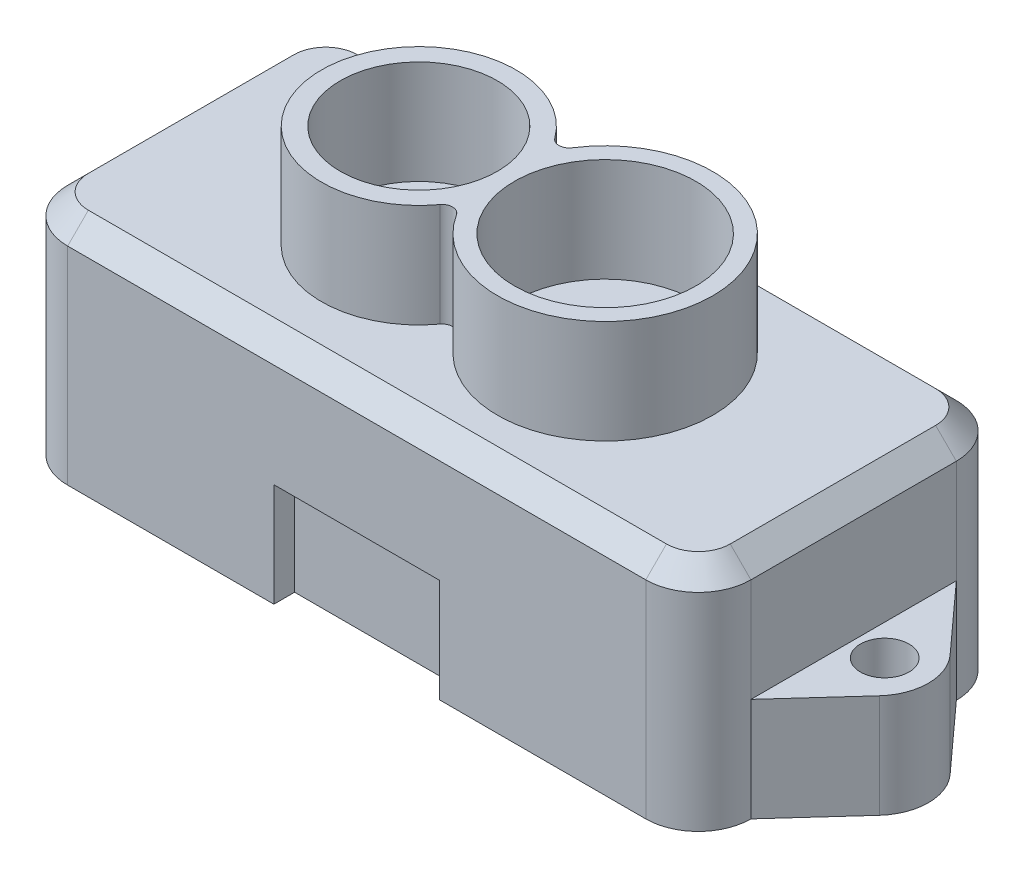
ISO-10303-21;
HEADER;
FILE_DESCRIPTION(('STEP AP214'),'2;1');
FILE_NAME('part.step','',(''),(''),'','','');
FILE_SCHEMA(('AUTOMOTIVE_DESIGN { 1 0 10303 214 1 1 1 1 }'));
ENDSEC;
DATA;
#1=APPLICATION_CONTEXT('core data for automotive mechanical design processes');
#2=APPLICATION_PROTOCOL_DEFINITION('international standard','automotive_design',2000,#1);
#3=PRODUCT_CONTEXT('',#1,'mechanical');
#4=PRODUCT('Part','Part','',(#3));
#5=PRODUCT_RELATED_PRODUCT_CATEGORY('part','',(#4));
#6=PRODUCT_DEFINITION_FORMATION('','',#4);
#7=PRODUCT_DEFINITION_CONTEXT('part definition',#1,'design');
#8=PRODUCT_DEFINITION('design','',#6,#7);
#9=PRODUCT_DEFINITION_SHAPE('','',#8);
#10=(LENGTH_UNIT() NAMED_UNIT(*) SI_UNIT(.MILLI.,.METRE.));
#11=(NAMED_UNIT(*) PLANE_ANGLE_UNIT() SI_UNIT($,.RADIAN.));
#12=(NAMED_UNIT(*) SI_UNIT($,.STERADIAN.) SOLID_ANGLE_UNIT());
#13=UNCERTAINTY_MEASURE_WITH_UNIT(LENGTH_MEASURE(1.E-05),#10,'distance_accuracy_value','');
#14=(GEOMETRIC_REPRESENTATION_CONTEXT(3) GLOBAL_UNCERTAINTY_ASSIGNED_CONTEXT((#13)) GLOBAL_UNIT_ASSIGNED_CONTEXT((#10,
#11,#12)) REPRESENTATION_CONTEXT('',''));
#15=CARTESIAN_POINT('',(0.,0.,0.));
#16=DIRECTION('',(0.,0.,1.));
#17=DIRECTION('',(1.,0.,0.));
#18=AXIS2_PLACEMENT_3D('',#15,#16,#17);
#19=CARTESIAN_POINT('',(-16.5,5.5,-4.95999999999998));
#20=DIRECTION('',(1.,0.,0.));
#21=DIRECTION('',(0.,0.,-1.));
#22=AXIS2_PLACEMENT_3D('',#19,#20,#21);
#23=PLANE('',#22);
#24=DIRECTION('',(0.,-1.,0.));
#25=VECTOR('',#24,1.);
#26=CARTESIAN_POINT('',(-16.5,5.5,4.95999999999998));
#27=LINE('',#26,#25);
#28=CARTESIAN_POINT('',(-16.5,4.49999999999998,4.95999999999998));
#29=VERTEX_POINT('',#28);
#30=CARTESIAN_POINT('',(-16.5,-0.5,4.95999999999998));
#31=VERTEX_POINT('',#30);
#32=EDGE_CURVE('E381',#29,#31,#27,.T.);
#33=ORIENTED_EDGE('',*,*,#32,.F.);
#34=DIRECTION('',(0.,0.,-1.));
#35=VECTOR('',#34,1.);
#36=CARTESIAN_POINT('',(-16.5,4.49999999999998,-4.95999999999998));
#37=LINE('',#36,#35);
#38=CARTESIAN_POINT('',(-16.5,4.49999999999998,-4.95999999999998));
#39=VERTEX_POINT('',#38);
#40=EDGE_CURVE('E416',#29,#39,#37,.T.);
#41=ORIENTED_EDGE('',*,*,#40,.T.);
#42=DIRECTION('',(0.,-1.,0.));
#43=VECTOR('',#42,1.);
#44=CARTESIAN_POINT('',(-16.5,5.5,-4.95999999999998));
#45=LINE('',#44,#43);
#46=CARTESIAN_POINT('',(-16.5,-0.5,-4.95999999999998));
#47=VERTEX_POINT('',#46);
#48=EDGE_CURVE('E383',#39,#47,#45,.T.);
#49=ORIENTED_EDGE('',*,*,#48,.T.);
#50=DIRECTION('',(0.,0.,-1.));
#51=VECTOR('',#50,1.);
#52=CARTESIAN_POINT('',(-16.5,-0.5,-4.95999999999998));
#53=LINE('',#52,#51);
#54=EDGE_CURVE('E336',#31,#47,#53,.T.);
#55=ORIENTED_EDGE('',*,*,#54,.F.);
#56=EDGE_LOOP('',(#33,#41,#49,#55));
#57=FACE_BOUND('',#56,.T.);
#58=ADVANCED_FACE('F32',(#57),#23,.F.);
#59=CARTESIAN_POINT('',(16.5,5.5,-4.95999999999998));
#60=DIRECTION('',(-1.,0.,0.));
#61=DIRECTION('',(0.,0.,1.));
#62=AXIS2_PLACEMENT_3D('',#59,#60,#61);
#63=PLANE('',#62);
#64=DIRECTION('',(0.,-1.,0.));
#65=VECTOR('',#64,1.);
#66=CARTESIAN_POINT('',(16.5,5.5,-4.95999999999998));
#67=LINE('',#66,#65);
#68=CARTESIAN_POINT('',(16.5,4.49999999999998,-4.95999999999998));
#69=VERTEX_POINT('',#68);
#70=CARTESIAN_POINT('',(16.5,-0.5,-4.95999999999998));
#71=VERTEX_POINT('',#70);
#72=EDGE_CURVE('E372',#69,#71,#67,.T.);
#73=ORIENTED_EDGE('',*,*,#72,.F.);
#74=DIRECTION('',(0.,0.,1.));
#75=VECTOR('',#74,1.);
#76=CARTESIAN_POINT('',(16.5,4.49999999999998,-4.95999999999998));
#77=LINE('',#76,#75);
#78=CARTESIAN_POINT('',(16.5,4.49999999999998,4.95999999999998));
#79=VERTEX_POINT('',#78);
#80=EDGE_CURVE('E418',#69,#79,#77,.T.);
#81=ORIENTED_EDGE('',*,*,#80,.T.);
#82=DIRECTION('',(0.,-1.,0.));
#83=VECTOR('',#82,1.);
#84=CARTESIAN_POINT('',(16.5,5.5,4.95999999999998));
#85=LINE('',#84,#83);
#86=CARTESIAN_POINT('',(16.5,-0.5,4.95999999999998));
#87=VERTEX_POINT('',#86);
#88=EDGE_CURVE('E374',#79,#87,#85,.T.);
#89=ORIENTED_EDGE('',*,*,#88,.T.);
#90=DIRECTION('',(0.,0.,1.));
#91=VECTOR('',#90,1.);
#92=CARTESIAN_POINT('',(16.5,-0.5,-4.95999999999998));
#93=LINE('',#92,#91);
#94=EDGE_CURVE('E389',#71,#87,#93,.T.);
#95=ORIENTED_EDGE('',*,*,#94,.F.);
#96=EDGE_LOOP('',(#73,#81,#89,#95));
#97=FACE_BOUND('',#96,.T.);
#98=ADVANCED_FACE('F488',(#97),#63,.F.);
#99=CARTESIAN_POINT('',(13.96,5.5,-4.96));
#100=DIRECTION('',(0.,-1.,0.));
#101=DIRECTION('',(0.,0.,-1.));
#102=AXIS2_PLACEMENT_3D('',#99,#100,#101);
#103=CYLINDRICAL_SURFACE('',#102,2.54);
#104=DIRECTION('',(0.,-1.,0.));
#105=VECTOR('',#104,1.);
#106=CARTESIAN_POINT('',(13.96,5.5,-7.5));
#107=LINE('',#106,#105);
#108=CARTESIAN_POINT('',(13.96,4.49999999999998,-7.5));
#109=VERTEX_POINT('',#108);
#110=CARTESIAN_POINT('',(13.96,-5.5,-7.5));
#111=VERTEX_POINT('',#110);
#112=EDGE_CURVE('E387',#109,#111,#107,.T.);
#113=ORIENTED_EDGE('',*,*,#112,.F.);
#114=CARTESIAN_POINT('',(13.96,4.49999999999998,-4.96));
#115=DIRECTION('',(0.,-1.,0.));
#116=DIRECTION('',(0.,0.,-1.));
#117=AXIS2_PLACEMENT_3D('',#114,#115,#116);
#118=CIRCLE('',#117,2.54);
#119=EDGE_CURVE('E414',#109,#69,#118,.T.);
#120=ORIENTED_EDGE('',*,*,#119,.T.);
#121=ORIENTED_EDGE('',*,*,#72,.T.);
#122=DIRECTION('',(0.,-1.,0.));
#123=VECTOR('',#122,1.);
#124=CARTESIAN_POINT('',(16.5,-0.5,-4.96));
#125=LINE('',#124,#123);
#126=CARTESIAN_POINT('',(16.5,-5.5,-4.96));
#127=VERTEX_POINT('',#126);
#128=EDGE_CURVE('E341',#71,#127,#125,.T.);
#129=ORIENTED_EDGE('',*,*,#128,.T.);
#130=CARTESIAN_POINT('',(13.96,-5.5,-4.96));
#131=DIRECTION('',(0.,1.,0.));
#132=DIRECTION('',(0.,0.,-1.));
#133=AXIS2_PLACEMENT_3D('',#130,#131,#132);
#134=CIRCLE('',#133,2.54);
#135=EDGE_CURVE('E354',#127,#111,#134,.T.);
#136=ORIENTED_EDGE('',*,*,#135,.T.);
#137=EDGE_LOOP('',(#113,#120,#121,#129,#136));
#138=FACE_BOUND('',#137,.T.);
#139=ADVANCED_FACE('F495',(#138),#103,.T.);
#140=CARTESIAN_POINT('',(-13.96,5.5,-7.5));
#141=DIRECTION('',(0.,0.,1.));
#142=DIRECTION('',(1.,0.,0.));
#143=AXIS2_PLACEMENT_3D('',#140,#141,#142);
#144=PLANE('',#143);
#145=DIRECTION('',(0.,-1.,0.));
#146=VECTOR('',#145,1.);
#147=CARTESIAN_POINT('',(-13.96,5.5,-7.5));
#148=LINE('',#147,#146);
#149=CARTESIAN_POINT('',(-13.96,4.49999999999998,-7.5));
#150=VERTEX_POINT('',#149);
#151=CARTESIAN_POINT('',(-13.96,-5.5,-7.5));
#152=VERTEX_POINT('',#151);
#153=EDGE_CURVE('E385',#150,#152,#148,.T.);
#154=ORIENTED_EDGE('',*,*,#153,.F.);
#155=DIRECTION('',(1.,0.,0.));
#156=VECTOR('',#155,1.);
#157=CARTESIAN_POINT('',(-13.96,4.49999999999998,-7.5));
#158=LINE('',#157,#156);
#159=EDGE_CURVE('E409',#150,#109,#158,.T.);
#160=ORIENTED_EDGE('',*,*,#159,.T.);
#161=ORIENTED_EDGE('',*,*,#112,.T.);
#162=DIRECTION('',(-1.,0.,0.));
#163=VECTOR('',#162,1.);
#164=CARTESIAN_POINT('',(-13.96,-5.5,-7.5));
#165=LINE('',#164,#163);
#166=EDGE_CURVE('E357',#111,#152,#165,.T.);
#167=ORIENTED_EDGE('',*,*,#166,.T.);
#168=EDGE_LOOP('',(#154,#160,#161,#167));
#169=FACE_BOUND('',#168,.T.);
#170=ADVANCED_FACE('F506',(#169),#144,.F.);
#171=CARTESIAN_POINT('',(-13.96,5.5,-4.96));
#172=DIRECTION('',(0.,-1.,0.));
#173=DIRECTION('',(0.,0.,-1.));
#174=AXIS2_PLACEMENT_3D('',#171,#172,#173);
#175=CYLINDRICAL_SURFACE('',#174,2.54);
#176=ORIENTED_EDGE('',*,*,#48,.F.);
#177=CARTESIAN_POINT('',(-13.96,4.49999999999998,-4.96));
#178=DIRECTION('',(0.,-1.,0.));
#179=DIRECTION('',(0.,0.,-1.));
#180=AXIS2_PLACEMENT_3D('',#177,#178,#179);
#181=CIRCLE('',#180,2.54);
#182=EDGE_CURVE('E412',#39,#150,#181,.T.);
#183=ORIENTED_EDGE('',*,*,#182,.T.);
#184=ORIENTED_EDGE('',*,*,#153,.T.);
#185=CARTESIAN_POINT('',(-13.96,-5.5,-4.96));
#186=DIRECTION('',(0.,1.,0.));
#187=DIRECTION('',(0.,0.,1.));
#188=AXIS2_PLACEMENT_3D('',#185,#186,#187);
#189=CIRCLE('',#188,2.54);
#190=CARTESIAN_POINT('',(-16.5,-5.5,-4.95999999999998));
#191=VERTEX_POINT('',#190);
#192=EDGE_CURVE('E360',#152,#191,#189,.T.);
#193=ORIENTED_EDGE('',*,*,#192,.T.);
#194=DIRECTION('',(0.,-1.,0.));
#195=VECTOR('',#194,1.);
#196=CARTESIAN_POINT('',(-16.5,-0.5,-4.95999999999998));
#197=LINE('',#196,#195);
#198=EDGE_CURVE('E344',#47,#191,#197,.T.);
#199=ORIENTED_EDGE('',*,*,#198,.F.);
#200=EDGE_LOOP('',(#176,#183,#184,#193,#199));
#201=FACE_BOUND('',#200,.T.);
#202=ADVANCED_FACE('F543',(#201),#175,.T.);
#203=CARTESIAN_POINT('',(-13.96,5.5,4.96));
#204=DIRECTION('',(0.,-1.,0.));
#205=DIRECTION('',(0.,0.,-1.));
#206=AXIS2_PLACEMENT_3D('',#203,#204,#205);
#207=CYLINDRICAL_SURFACE('',#206,2.54);
#208=DIRECTION('',(0.,-1.,0.));
#209=VECTOR('',#208,1.);
#210=CARTESIAN_POINT('',(-13.96,5.5,7.5));
#211=LINE('',#210,#209);
#212=CARTESIAN_POINT('',(-13.96,4.49999999999998,7.5));
#213=VERTEX_POINT('',#212);
#214=CARTESIAN_POINT('',(-13.96,-5.5,7.5));
#215=VERTEX_POINT('',#214);
#216=EDGE_CURVE('E379',#213,#215,#211,.T.);
#217=ORIENTED_EDGE('',*,*,#216,.F.);
#218=CARTESIAN_POINT('',(-13.96,4.49999999999998,4.96));
#219=DIRECTION('',(0.,-1.,0.));
#220=DIRECTION('',(0.,0.,-1.));
#221=AXIS2_PLACEMENT_3D('',#218,#219,#220);
#222=CIRCLE('',#221,2.54);
#223=EDGE_CURVE('E420',#213,#29,#222,.T.);
#224=ORIENTED_EDGE('',*,*,#223,.T.);
#225=ORIENTED_EDGE('',*,*,#32,.T.);
#226=DIRECTION('',(0.,-1.,0.));
#227=VECTOR('',#226,1.);
#228=CARTESIAN_POINT('',(-16.5,-0.5,4.95999999999998));
#229=LINE('',#228,#227);
#230=CARTESIAN_POINT('',(-16.5,-5.5,4.95999999999998));
#231=VERTEX_POINT('',#230);
#232=EDGE_CURVE('E316',#31,#231,#229,.T.);
#233=ORIENTED_EDGE('',*,*,#232,.T.);
#234=CARTESIAN_POINT('',(-13.96,-5.5,4.96));
#235=DIRECTION('',(0.,1.,0.));
#236=DIRECTION('',(0.,0.,1.));
#237=AXIS2_PLACEMENT_3D('',#234,#235,#236);
#238=CIRCLE('',#237,2.54);
#239=EDGE_CURVE('E363',#231,#215,#238,.T.);
#240=ORIENTED_EDGE('',*,*,#239,.T.);
#241=EDGE_LOOP('',(#217,#224,#225,#233,#240));
#242=FACE_BOUND('',#241,.T.);
#243=ADVANCED_FACE('F458',(#242),#207,.T.);
#244=CARTESIAN_POINT('',(-13.96,5.5,7.5));
#245=DIRECTION('',(0.,0.,-1.));
#246=DIRECTION('',(-1.,0.,0.));
#247=AXIS2_PLACEMENT_3D('',#244,#245,#246);
#248=PLANE('',#247);
#249=DIRECTION('',(-1.,0.,0.));
#250=VECTOR('',#249,1.);
#251=CARTESIAN_POINT('',(-4.,-0.5,7.5));
#252=LINE('',#251,#250);
#253=CARTESIAN_POINT('',(4.,-0.5,7.5));
#254=VERTEX_POINT('',#253);
#255=CARTESIAN_POINT('',(-4.,-0.5,7.5));
#256=VERTEX_POINT('',#255);
#257=EDGE_CURVE('E228',#254,#256,#252,.T.);
#258=ORIENTED_EDGE('',*,*,#257,.F.);
#259=DIRECTION('',(0.,1.,0.));
#260=VECTOR('',#259,1.);
#261=CARTESIAN_POINT('',(4.,-0.5,7.5));
#262=LINE('',#261,#260);
#263=CARTESIAN_POINT('',(4.,-5.5,7.5));
#264=VERTEX_POINT('',#263);
#265=EDGE_CURVE('E213',#264,#254,#262,.T.);
#266=ORIENTED_EDGE('',*,*,#265,.F.);
#267=DIRECTION('',(1.,0.,0.));
#268=VECTOR('',#267,1.);
#269=CARTESIAN_POINT('',(-13.96,-5.5,7.5));
#270=LINE('',#269,#268);
#271=CARTESIAN_POINT('',(13.96,-5.5,7.5));
#272=VERTEX_POINT('',#271);
#273=EDGE_CURVE('E366',#264,#272,#270,.T.);
#274=ORIENTED_EDGE('',*,*,#273,.T.);
#275=DIRECTION('',(0.,-1.,0.));
#276=VECTOR('',#275,1.);
#277=CARTESIAN_POINT('',(13.96,5.5,7.5));
#278=LINE('',#277,#276);
#279=CARTESIAN_POINT('',(13.96,4.49999999999998,7.5));
#280=VERTEX_POINT('',#279);
#281=EDGE_CURVE('E376',#280,#272,#278,.T.);
#282=ORIENTED_EDGE('',*,*,#281,.F.);
#283=DIRECTION('',(-1.,0.,0.));
#284=VECTOR('',#283,1.);
#285=CARTESIAN_POINT('',(-13.96,4.49999999999998,7.5));
#286=LINE('',#285,#284);
#287=EDGE_CURVE('E11',#280,#213,#286,.T.);
#288=ORIENTED_EDGE('',*,*,#287,.T.);
#289=ORIENTED_EDGE('',*,*,#216,.T.);
#290=CARTESIAN_POINT('',(-4.,-5.5,7.5));
#291=VERTEX_POINT('',#290);
#292=EDGE_CURVE('E367',#215,#291,#270,.T.);
#293=ORIENTED_EDGE('',*,*,#292,.T.);
#294=DIRECTION('',(0.,-1.,0.));
#295=VECTOR('',#294,1.);
#296=CARTESIAN_POINT('',(-4.,-0.5,7.5));
#297=LINE('',#296,#295);
#298=EDGE_CURVE('E226',#256,#291,#297,.T.);
#299=ORIENTED_EDGE('',*,*,#298,.F.);
#300=EDGE_LOOP('',(#258,#266,#274,#282,#288,#289,#293,#299));
#301=FACE_BOUND('',#300,.T.);
#302=ADVANCED_FACE('F456',(#301),#248,.F.);
#303=CARTESIAN_POINT('',(13.96,5.5,4.96));
#304=DIRECTION('',(0.,-1.,0.));
#305=DIRECTION('',(0.,0.,-1.));
#306=AXIS2_PLACEMENT_3D('',#303,#304,#305);
#307=CYLINDRICAL_SURFACE('',#306,2.54);
#308=ORIENTED_EDGE('',*,*,#88,.F.);
#309=CARTESIAN_POINT('',(13.96,4.49999999999998,4.96));
#310=DIRECTION('',(0.,-1.,0.));
#311=DIRECTION('',(0.,0.,-1.));
#312=AXIS2_PLACEMENT_3D('',#309,#310,#311);
#313=CIRCLE('',#312,2.54);
#314=EDGE_CURVE('E41',#79,#280,#313,.T.);
#315=ORIENTED_EDGE('',*,*,#314,.T.);
#316=ORIENTED_EDGE('',*,*,#281,.T.);
#317=CARTESIAN_POINT('',(13.96,-5.5,4.96));
#318=DIRECTION('',(0.,1.,0.));
#319=DIRECTION('',(0.,0.,1.));
#320=AXIS2_PLACEMENT_3D('',#317,#318,#319);
#321=CIRCLE('',#320,2.54);
#322=CARTESIAN_POINT('',(16.5,-5.5,4.95999999999998));
#323=VERTEX_POINT('',#322);
#324=EDGE_CURVE('E370',#272,#323,#321,.T.);
#325=ORIENTED_EDGE('',*,*,#324,.T.);
#326=DIRECTION('',(0.,-1.,0.));
#327=VECTOR('',#326,1.);
#328=CARTESIAN_POINT('',(16.5,-0.5,4.95999999999998));
#329=LINE('',#328,#327);
#330=EDGE_CURVE('E333',#87,#323,#329,.T.);
#331=ORIENTED_EDGE('',*,*,#330,.F.);
#332=EDGE_LOOP('',(#308,#315,#316,#325,#331));
#333=FACE_BOUND('',#332,.T.);
#334=ADVANCED_FACE('F473',(#333),#307,.T.);
#335=CARTESIAN_POINT('',(13.96,5.5,-4.96));
#336=DIRECTION('',(0.,-1.,0.));
#337=DIRECTION('',(0.,0.,-1.));
#338=AXIS2_PLACEMENT_3D('',#335,#336,#337);
#339=PLANE('',#338);
#340=CARTESIAN_POINT('',(-0.302777777777775,5.5,3.06974357516779));
#341=DIRECTION('',(0.,-1.,0.));
#342=DIRECTION('',(0.,0.,1.));
#343=AXIS2_PLACEMENT_3D('',#340,#341,#342);
#344=CIRCLE('',#343,0.5);
#345=CARTESIAN_POINT('',(-0.706356837606835,5.5,2.77457592370935));
#346=VERTEX_POINT('',#345);
#347=CARTESIAN_POINT('',(0.118518518518522,5.5,2.80046782296009));
#348=VERTEX_POINT('',#347);
#349=EDGE_CURVE('E251',#346,#348,#344,.T.);
#350=ORIENTED_EDGE('',*,*,#349,.F.);
#351=CARTESIAN_POINT('',(-4.5,5.5,0.));
#352=DIRECTION('',(0.,1.,0.));
#353=DIRECTION('',(0.,0.,1.));
#354=AXIS2_PLACEMENT_3D('',#351,#352,#353);
#355=CIRCLE('',#354,4.7);
#356=CARTESIAN_POINT('',(-0.706356837606835,5.5,-2.77457592370935));
#357=VERTEX_POINT('',#356);
#358=EDGE_CURVE('E258',#357,#346,#355,.T.);
#359=ORIENTED_EDGE('',*,*,#358,.F.);
#360=CARTESIAN_POINT('',(-0.302777777777775,5.5,-3.06974357516779));
#361=DIRECTION('',(0.,-1.,0.));
#362=DIRECTION('',(0.,0.,-1.));
#363=AXIS2_PLACEMENT_3D('',#360,#361,#362);
#364=CIRCLE('',#363,0.5);
#365=CARTESIAN_POINT('',(0.11851851851852,5.5,-2.80046782296009));
#366=VERTEX_POINT('',#365);
#367=EDGE_CURVE('E268',#366,#357,#364,.T.);
#368=ORIENTED_EDGE('',*,*,#367,.F.);
#369=CARTESIAN_POINT('',(4.5,5.5,0.));
#370=DIRECTION('',(0.,1.,0.));
#371=DIRECTION('',(0.,0.,1.));
#372=AXIS2_PLACEMENT_3D('',#369,#370,#371);
#373=CIRCLE('',#372,5.2);
#374=EDGE_CURVE('E57',#348,#366,#373,.T.);
#375=ORIENTED_EDGE('',*,*,#374,.F.);
#376=EDGE_LOOP('',(#350,#359,#368,#375));
#377=FACE_BOUND('',#376,.T.);
#378=CARTESIAN_POINT('',(13.96,5.5,-4.96));
#379=DIRECTION('',(0.,-1.,0.));
#380=DIRECTION('',(0.,0.,-1.));
#381=AXIS2_PLACEMENT_3D('',#378,#379,#380);
#382=CIRCLE('',#381,1.53999999999999);
#383=CARTESIAN_POINT('',(15.5,5.5,-4.95999999999999));
#384=VERTEX_POINT('',#383);
#385=CARTESIAN_POINT('',(13.96,5.5,-6.5));
#386=VERTEX_POINT('',#385);
#387=EDGE_CURVE('E402',#384,#386,#382,.F.);
#388=ORIENTED_EDGE('',*,*,#387,.T.);
#389=DIRECTION('',(-1.,0.,0.));
#390=VECTOR('',#389,1.);
#391=CARTESIAN_POINT('',(13.96,5.5,-6.49999999999999));
#392=LINE('',#391,#390);
#393=CARTESIAN_POINT('',(-13.96,5.5,-6.5));
#394=VERTEX_POINT('',#393);
#395=EDGE_CURVE('E406',#386,#394,#392,.T.);
#396=ORIENTED_EDGE('',*,*,#395,.T.);
#397=CARTESIAN_POINT('',(-13.96,5.5,-4.96));
#398=DIRECTION('',(0.,-1.,0.));
#399=DIRECTION('',(0.,0.,-1.));
#400=AXIS2_PLACEMENT_3D('',#397,#398,#399);
#401=CIRCLE('',#400,1.53999999999999);
#402=CARTESIAN_POINT('',(-15.5,5.5,-4.95999999999999));
#403=VERTEX_POINT('',#402);
#404=EDGE_CURVE('E404',#394,#403,#401,.F.);
#405=ORIENTED_EDGE('',*,*,#404,.T.);
#406=DIRECTION('',(0.,0.,1.));
#407=VECTOR('',#406,1.);
#408=CARTESIAN_POINT('',(-15.5,5.5,-4.95999999999998));
#409=LINE('',#408,#407);
#410=CARTESIAN_POINT('',(-15.5,5.5,4.95999999999998));
#411=VERTEX_POINT('',#410);
#412=EDGE_CURVE('E400',#403,#411,#409,.T.);
#413=ORIENTED_EDGE('',*,*,#412,.T.);
#414=CARTESIAN_POINT('',(-13.96,5.5,4.96));
#415=DIRECTION('',(0.,-1.,0.));
#416=DIRECTION('',(0.,0.,-1.));
#417=AXIS2_PLACEMENT_3D('',#414,#415,#416);
#418=CIRCLE('',#417,1.53999999999999);
#419=CARTESIAN_POINT('',(-13.96,5.5,6.49999999999999));
#420=VERTEX_POINT('',#419);
#421=EDGE_CURVE('E396',#411,#420,#418,.F.);
#422=ORIENTED_EDGE('',*,*,#421,.T.);
#423=DIRECTION('',(1.,0.,0.));
#424=VECTOR('',#423,1.);
#425=CARTESIAN_POINT('',(13.96,5.5,6.49999999999999));
#426=LINE('',#425,#424);
#427=CARTESIAN_POINT('',(13.96,5.5,6.49999999999999));
#428=VERTEX_POINT('',#427);
#429=EDGE_CURVE('E392',#420,#428,#426,.T.);
#430=ORIENTED_EDGE('',*,*,#429,.T.);
#431=CARTESIAN_POINT('',(13.96,5.5,4.96));
#432=DIRECTION('',(0.,-1.,0.));
#433=DIRECTION('',(0.,0.,-1.));
#434=AXIS2_PLACEMENT_3D('',#431,#432,#433);
#435=CIRCLE('',#434,1.53999999999999);
#436=CARTESIAN_POINT('',(15.5,5.5,4.95999999999998));
#437=VERTEX_POINT('',#436);
#438=EDGE_CURVE('E394',#428,#437,#435,.F.);
#439=ORIENTED_EDGE('',*,*,#438,.T.);
#440=DIRECTION('',(0.,0.,-1.));
#441=VECTOR('',#440,1.);
#442=CARTESIAN_POINT('',(15.5,5.5,-4.96));
#443=LINE('',#442,#441);
#444=EDGE_CURVE('E398',#437,#384,#443,.T.);
#445=ORIENTED_EDGE('',*,*,#444,.T.);
#446=EDGE_LOOP('',(#388,#396,#405,#413,#422,#430,#439,#445));
#447=FACE_BOUND('',#446,.T.);
#448=ADVANCED_FACE('F518',(#377,#447),#339,.F.);
#449=CARTESIAN_POINT('',(13.96,-5.5,-4.96));
#450=DIRECTION('',(0.,-1.,0.));
#451=DIRECTION('',(0.,0.,-1.));
#452=AXIS2_PLACEMENT_3D('',#449,#450,#451);
#453=PLANE('',#452);
#454=DIRECTION('',(0.,0.,1.));
#455=VECTOR('',#454,1.);
#456=CARTESIAN_POINT('',(4.,-5.5,6.5));
#457=LINE('',#456,#455);
#458=CARTESIAN_POINT('',(4.,-5.5,6.5));
#459=VERTEX_POINT('',#458);
#460=EDGE_CURVE('E235',#459,#264,#457,.T.);
#461=ORIENTED_EDGE('',*,*,#460,.F.);
#462=DIRECTION('',(1.,0.,0.));
#463=VECTOR('',#462,1.);
#464=CARTESIAN_POINT('',(-4.,-5.5,6.5));
#465=LINE('',#464,#463);
#466=CARTESIAN_POINT('',(-4.,-5.5,6.5));
#467=VERTEX_POINT('',#466);
#468=EDGE_CURVE('E218',#467,#459,#465,.T.);
#469=ORIENTED_EDGE('',*,*,#468,.F.);
#470=DIRECTION('',(0.,0.,1.));
#471=VECTOR('',#470,1.);
#472=CARTESIAN_POINT('',(-4.,-5.5,6.5));
#473=LINE('',#472,#471);
#474=EDGE_CURVE('E238',#467,#291,#473,.T.);
#475=ORIENTED_EDGE('',*,*,#474,.T.);
#476=ORIENTED_EDGE('',*,*,#292,.F.);
#477=ORIENTED_EDGE('',*,*,#239,.F.);
#478=DIRECTION('',(-0.671929244857392,0.,-0.740615345442811));
#479=VECTOR('',#478,1.);
#480=CARTESIAN_POINT('',(-16.5,-5.5,4.95999999999998));
#481=LINE('',#480,#479);
#482=CARTESIAN_POINT('',(-19.4515824055,-5.5,1.70670028193779));
#483=VERTEX_POINT('',#482);
#484=EDGE_CURVE('E294',#231,#483,#481,.T.);
#485=ORIENTED_EDGE('',*,*,#484,.T.);
#486=CARTESIAN_POINT('',(-17.5704194280753,-5.5,0.));
#487=DIRECTION('',(0.,-1.,0.));
#488=DIRECTION('',(0.,0.,-1.));
#489=AXIS2_PLACEMENT_3D('',#486,#487,#488);
#490=CIRCLE('',#489,2.54);
#491=CARTESIAN_POINT('',(-19.4515824055,-5.5,-1.70670028193779));
#492=VERTEX_POINT('',#491);
#493=EDGE_CURVE('E319',#483,#492,#490,.T.);
#494=ORIENTED_EDGE('',*,*,#493,.T.);
#495=DIRECTION('',(0.671929244857391,0.,-0.740615345442812));
#496=VECTOR('',#495,1.);
#497=CARTESIAN_POINT('',(-19.4515824055,-5.5,-1.70670028193779));
#498=LINE('',#497,#496);
#499=EDGE_CURVE('E322',#492,#191,#498,.T.);
#500=ORIENTED_EDGE('',*,*,#499,.T.);
#501=ORIENTED_EDGE('',*,*,#192,.F.);
#502=ORIENTED_EDGE('',*,*,#166,.F.);
#503=ORIENTED_EDGE('',*,*,#135,.F.);
#504=DIRECTION('',(0.67192924485739,0.,0.740615345442813));
#505=VECTOR('',#504,1.);
#506=CARTESIAN_POINT('',(16.5,-5.5,-4.96));
#507=LINE('',#506,#505);
#508=CARTESIAN_POINT('',(19.4515824055,-5.5,-1.70670028193778));
#509=VERTEX_POINT('',#508);
#510=EDGE_CURVE('E325',#127,#509,#507,.T.);
#511=ORIENTED_EDGE('',*,*,#510,.T.);
#512=CARTESIAN_POINT('',(17.5704194280753,-5.5,0.));
#513=DIRECTION('',(0.,-1.,0.));
#514=DIRECTION('',(0.,0.,-1.));
#515=AXIS2_PLACEMENT_3D('',#512,#513,#514);
#516=CIRCLE('',#515,2.54);
#517=CARTESIAN_POINT('',(19.4515824055,-5.5,1.70670028193777));
#518=VERTEX_POINT('',#517);
#519=EDGE_CURVE('E328',#509,#518,#516,.T.);
#520=ORIENTED_EDGE('',*,*,#519,.T.);
#521=DIRECTION('',(-0.671929244857393,0.,0.740615345442811));
#522=VECTOR('',#521,1.);
#523=CARTESIAN_POINT('',(19.4515824055,-5.5,1.70670028193778));
#524=LINE('',#523,#522);
#525=EDGE_CURVE('E301',#518,#323,#524,.T.);
#526=ORIENTED_EDGE('',*,*,#525,.T.);
#527=ORIENTED_EDGE('',*,*,#324,.F.);
#528=ORIENTED_EDGE('',*,*,#273,.F.);
#529=EDGE_LOOP('',(#461,#469,#475,#476,#477,#485,#494,#500,#501,#502,#503,#511,#520,#526,#527,#528));
#530=FACE_BOUND('',#529,.T.);
#531=CARTESIAN_POINT('',(18.,-5.5,0.));
#532=DIRECTION('',(0.,-1.,0.));
#533=DIRECTION('',(0.,0.,-1.));
#534=AXIS2_PLACEMENT_3D('',#531,#532,#533);
#535=CIRCLE('',#534,1.175);
#536=CARTESIAN_POINT('',(18.,-5.5,-1.175));
#537=VERTEX_POINT('',#536);
#538=EDGE_CURVE('E287',#537,#537,#535,.T.);
#539=ORIENTED_EDGE('',*,*,#538,.F.);
#540=EDGE_LOOP('',(#539));
#541=FACE_BOUND('',#540,.T.);
#542=CARTESIAN_POINT('',(-18.,-5.5,0.));
#543=DIRECTION('',(0.,-1.,0.));
#544=DIRECTION('',(0.,0.,-1.));
#545=AXIS2_PLACEMENT_3D('',#542,#543,#544);
#546=CIRCLE('',#545,1.175);
#547=CARTESIAN_POINT('',(-18.,-5.5,-1.175));
#548=VERTEX_POINT('',#547);
#549=EDGE_CURVE('E288',#548,#548,#546,.T.);
#550=ORIENTED_EDGE('',*,*,#549,.F.);
#551=EDGE_LOOP('',(#550));
#552=FACE_BOUND('',#551,.T.);
#553=ADVANCED_FACE('F464',(#530,#541,#552),#453,.T.);
#554=CARTESIAN_POINT('',(17.5704194280753,-0.5,0.));
#555=DIRECTION('',(0.,-1.,0.));
#556=DIRECTION('',(0.,0.,-1.));
#557=AXIS2_PLACEMENT_3D('',#554,#555,#556);
#558=CYLINDRICAL_SURFACE('',#557,2.54);
#559=ORIENTED_EDGE('',*,*,#519,.F.);
#560=DIRECTION('',(0.,-1.,0.));
#561=VECTOR('',#560,1.);
#562=CARTESIAN_POINT('',(19.4515824055,-0.5,-1.70670028193778));
#563=LINE('',#562,#561);
#564=CARTESIAN_POINT('',(19.4515824055,-0.5,-1.70670028193778));
#565=VERTEX_POINT('',#564);
#566=EDGE_CURVE('E339',#565,#509,#563,.T.);
#567=ORIENTED_EDGE('',*,*,#566,.F.);
#568=CARTESIAN_POINT('',(17.5704194280753,-0.5,0.));
#569=DIRECTION('',(0.,-1.,0.));
#570=DIRECTION('',(0.,0.,-1.));
#571=AXIS2_PLACEMENT_3D('',#568,#569,#570);
#572=CIRCLE('',#571,2.54);
#573=CARTESIAN_POINT('',(19.4515824055,-0.5,1.70670028193777));
#574=VERTEX_POINT('',#573);
#575=EDGE_CURVE('E310',#565,#574,#572,.T.);
#576=ORIENTED_EDGE('',*,*,#575,.T.);
#577=DIRECTION('',(0.,-1.,0.));
#578=VECTOR('',#577,1.);
#579=CARTESIAN_POINT('',(19.4515824055,-0.5,1.70670028193777));
#580=LINE('',#579,#578);
#581=EDGE_CURVE('E337',#574,#518,#580,.T.);
#582=ORIENTED_EDGE('',*,*,#581,.T.);
#583=EDGE_LOOP('',(#559,#567,#576,#582));
#584=FACE_BOUND('',#583,.T.);
#585=ADVANCED_FACE('F799',(#584),#558,.T.);
#586=CARTESIAN_POINT('',(18.,-0.5,0.));
#587=DIRECTION('',(0.,-1.,0.));
#588=DIRECTION('',(0.,0.,-1.));
#589=AXIS2_PLACEMENT_3D('',#586,#587,#588);
#590=CYLINDRICAL_SURFACE('',#589,1.175);
#591=CARTESIAN_POINT('',(18.,-0.5,0.));
#592=DIRECTION('',(0.,-1.,0.));
#593=DIRECTION('',(0.,0.,-1.));
#594=AXIS2_PLACEMENT_3D('',#591,#592,#593);
#595=CIRCLE('',#594,1.175);
#596=CARTESIAN_POINT('',(18.,-0.5,-1.175));
#597=VERTEX_POINT('',#596);
#598=EDGE_CURVE('E291',#597,#597,#595,.T.);
#599=ORIENTED_EDGE('',*,*,#598,.F.);
#600=EDGE_LOOP('',(#599));
#601=FACE_BOUND('',#600,.T.);
#602=ORIENTED_EDGE('',*,*,#538,.T.);
#603=EDGE_LOOP('',(#602));
#604=FACE_BOUND('',#603,.T.);
#605=ADVANCED_FACE('F791',(#601,#604),#590,.F.);
#606=CARTESIAN_POINT('',(-17.5704194280753,-0.5,0.));
#607=DIRECTION('',(0.,-1.,0.));
#608=DIRECTION('',(0.,0.,-1.));
#609=AXIS2_PLACEMENT_3D('',#606,#607,#608);
#610=PLANE('',#609);
#611=ORIENTED_EDGE('',*,*,#598,.T.);
#612=EDGE_LOOP('',(#611));
#613=FACE_BOUND('',#612,.T.);
#614=DIRECTION('',(0.67192924485739,0.,0.740615345442813));
#615=VECTOR('',#614,1.);
#616=CARTESIAN_POINT('',(16.5,-0.5,-4.96));
#617=LINE('',#616,#615);
#618=EDGE_CURVE('E307',#71,#565,#617,.T.);
#619=ORIENTED_EDGE('',*,*,#618,.F.);
#620=ORIENTED_EDGE('',*,*,#94,.T.);
#621=DIRECTION('',(-0.671929244857393,0.,0.740615345442811));
#622=VECTOR('',#621,1.);
#623=CARTESIAN_POINT('',(19.4515824055,-0.5,1.70670028193778));
#624=LINE('',#623,#622);
#625=EDGE_CURVE('E313',#574,#87,#624,.T.);
#626=ORIENTED_EDGE('',*,*,#625,.F.);
#627=ORIENTED_EDGE('',*,*,#575,.F.);
#628=EDGE_LOOP('',(#619,#620,#626,#627));
#629=FACE_BOUND('',#628,.T.);
#630=ADVANCED_FACE('F483',(#613,#629),#610,.F.);
#631=CARTESIAN_POINT('',(16.5,-0.5,-4.96));
#632=DIRECTION('',(0.740615345442813,0.,-0.67192924485739));
#633=DIRECTION('',(-0.67192924485739,0.,-0.740615345442813));
#634=AXIS2_PLACEMENT_3D('',#631,#632,#633);
#635=PLANE('',#634);
#636=ORIENTED_EDGE('',*,*,#510,.F.);
#637=ORIENTED_EDGE('',*,*,#128,.F.);
#638=ORIENTED_EDGE('',*,*,#618,.T.);
#639=ORIENTED_EDGE('',*,*,#566,.T.);
#640=EDGE_LOOP('',(#636,#637,#638,#639));
#641=FACE_BOUND('',#640,.T.);
#642=ADVANCED_FACE('F492',(#641),#635,.T.);
#643=CARTESIAN_POINT('',(19.4515824055,-0.5,1.70670028193778));
#644=DIRECTION('',(0.740615345442811,0.,0.671929244857393));
#645=DIRECTION('',(0.671929244857393,0.,-0.740615345442811));
#646=AXIS2_PLACEMENT_3D('',#643,#644,#645);
#647=PLANE('',#646);
#648=ORIENTED_EDGE('',*,*,#525,.F.);
#649=ORIENTED_EDGE('',*,*,#581,.F.);
#650=ORIENTED_EDGE('',*,*,#625,.T.);
#651=ORIENTED_EDGE('',*,*,#330,.T.);
#652=EDGE_LOOP('',(#648,#649,#650,#651));
#653=FACE_BOUND('',#652,.T.);
#654=ADVANCED_FACE('F478',(#653),#647,.T.);
#655=CARTESIAN_POINT('',(-18.,-0.5,0.));
#656=DIRECTION('',(0.,-1.,0.));
#657=DIRECTION('',(0.,0.,-1.));
#658=AXIS2_PLACEMENT_3D('',#655,#656,#657);
#659=CIRCLE('',#658,1.175);
#660=CARTESIAN_POINT('',(-18.,-0.5,-1.175));
#661=VERTEX_POINT('',#660);
#662=EDGE_CURVE('E284',#661,#661,#659,.T.);
#663=ORIENTED_EDGE('',*,*,#662,.T.);
#664=EDGE_LOOP('',(#663));
#665=FACE_BOUND('',#664,.T.);
#666=DIRECTION('',(-0.671929244857392,0.,-0.740615345442811));
#667=VECTOR('',#666,1.);
#668=CARTESIAN_POINT('',(-16.5,-0.5,4.95999999999998));
#669=LINE('',#668,#667);
#670=CARTESIAN_POINT('',(-19.4515824055,-0.5,1.70670028193779));
#671=VERTEX_POINT('',#670);
#672=EDGE_CURVE('E297',#31,#671,#669,.T.);
#673=ORIENTED_EDGE('',*,*,#672,.F.);
#674=ORIENTED_EDGE('',*,*,#54,.T.);
#675=DIRECTION('',(0.671929244857391,0.,-0.740615345442812));
#676=VECTOR('',#675,1.);
#677=CARTESIAN_POINT('',(-19.4515824055,-0.5,-1.70670028193779));
#678=LINE('',#677,#676);
#679=CARTESIAN_POINT('',(-19.4515824055,-0.5,-1.70670028193779));
#680=VERTEX_POINT('',#679);
#681=EDGE_CURVE('E304',#680,#47,#678,.T.);
#682=ORIENTED_EDGE('',*,*,#681,.F.);
#683=CARTESIAN_POINT('',(-17.5704194280753,-0.5,0.));
#684=DIRECTION('',(0.,-1.,0.));
#685=DIRECTION('',(0.,0.,-1.));
#686=AXIS2_PLACEMENT_3D('',#683,#684,#685);
#687=CIRCLE('',#686,2.54);
#688=EDGE_CURVE('E300',#671,#680,#687,.T.);
#689=ORIENTED_EDGE('',*,*,#688,.F.);
#690=EDGE_LOOP('',(#673,#674,#682,#689));
#691=FACE_BOUND('',#690,.T.);
#692=ADVANCED_FACE('F760',(#665,#691),#610,.F.);
#693=CARTESIAN_POINT('',(-19.4515824055,-0.5,-1.70670028193779));
#694=DIRECTION('',(-0.740615345442812,0.,-0.671929244857391));
#695=DIRECTION('',(-0.671929244857391,0.,0.740615345442812));
#696=AXIS2_PLACEMENT_3D('',#693,#694,#695);
#697=PLANE('',#696);
#698=ORIENTED_EDGE('',*,*,#499,.F.);
#699=DIRECTION('',(0.,-1.,0.));
#700=VECTOR('',#699,1.);
#701=CARTESIAN_POINT('',(-19.4515824055,-0.5,-1.70670028193779));
#702=LINE('',#701,#700);
#703=EDGE_CURVE('E346',#680,#492,#702,.T.);
#704=ORIENTED_EDGE('',*,*,#703,.F.);
#705=ORIENTED_EDGE('',*,*,#681,.T.);
#706=ORIENTED_EDGE('',*,*,#198,.T.);
#707=EDGE_LOOP('',(#698,#704,#705,#706));
#708=FACE_BOUND('',#707,.T.);
#709=ADVANCED_FACE('F751',(#708),#697,.T.);
#710=CARTESIAN_POINT('',(-17.5704194280753,-0.5,0.));
#711=DIRECTION('',(0.,-1.,0.));
#712=DIRECTION('',(0.,0.,-1.));
#713=AXIS2_PLACEMENT_3D('',#710,#711,#712);
#714=CYLINDRICAL_SURFACE('',#713,2.54);
#715=ORIENTED_EDGE('',*,*,#493,.F.);
#716=DIRECTION('',(0.,-1.,0.));
#717=VECTOR('',#716,1.);
#718=CARTESIAN_POINT('',(-19.4515824055,-0.5,1.70670028193779));
#719=LINE('',#718,#717);
#720=EDGE_CURVE('E348',#671,#483,#719,.T.);
#721=ORIENTED_EDGE('',*,*,#720,.F.);
#722=ORIENTED_EDGE('',*,*,#688,.T.);
#723=ORIENTED_EDGE('',*,*,#703,.T.);
#724=EDGE_LOOP('',(#715,#721,#722,#723));
#725=FACE_BOUND('',#724,.T.);
#726=ADVANCED_FACE('F742',(#725),#714,.T.);
#727=CARTESIAN_POINT('',(-16.5,-0.5,4.95999999999998));
#728=DIRECTION('',(-0.740615345442811,0.,0.671929244857392));
#729=DIRECTION('',(0.671929244857392,0.,0.740615345442811));
#730=AXIS2_PLACEMENT_3D('',#727,#728,#729);
#731=PLANE('',#730);
#732=ORIENTED_EDGE('',*,*,#484,.F.);
#733=ORIENTED_EDGE('',*,*,#232,.F.);
#734=ORIENTED_EDGE('',*,*,#672,.T.);
#735=ORIENTED_EDGE('',*,*,#720,.T.);
#736=EDGE_LOOP('',(#732,#733,#734,#735));
#737=FACE_BOUND('',#736,.T.);
#738=ADVANCED_FACE('F733',(#737),#731,.T.);
#739=CARTESIAN_POINT('',(-18.,-0.5,0.));
#740=DIRECTION('',(0.,-1.,0.));
#741=DIRECTION('',(0.,0.,-1.));
#742=AXIS2_PLACEMENT_3D('',#739,#740,#741);
#743=CYLINDRICAL_SURFACE('',#742,1.175);
#744=ORIENTED_EDGE('',*,*,#662,.F.);
#745=EDGE_LOOP('',(#744));
#746=FACE_BOUND('',#745,.T.);
#747=ORIENTED_EDGE('',*,*,#549,.T.);
#748=EDGE_LOOP('',(#747));
#749=FACE_BOUND('',#748,.T.);
#750=ADVANCED_FACE('F725',(#746,#749),#743,.F.);
#751=CARTESIAN_POINT('',(13.96,5.5,6.49999999999999));
#752=DIRECTION('',(0.,-0.707106781186545,-0.70710678118655));
#753=DIRECTION('',(1.,0.,0.));
#754=AXIS2_PLACEMENT_3D('',#751,#752,#753);
#755=PLANE('',#754);
#756=DIRECTION('',(0.,0.70710678118655,-0.707106781186545));
#757=VECTOR('',#756,1.);
#758=CARTESIAN_POINT('',(-13.96,4.49999999999998,7.5));
#759=LINE('',#758,#757);
#760=EDGE_CURVE('E437',#213,#420,#759,.T.);
#761=ORIENTED_EDGE('',*,*,#760,.F.);
#762=ORIENTED_EDGE('',*,*,#287,.F.);
#763=DIRECTION('',(0.,-0.70710678118655,0.707106781186545));
#764=VECTOR('',#763,1.);
#765=CARTESIAN_POINT('',(13.96,5.5,6.49999999999999));
#766=LINE('',#765,#764);
#767=EDGE_CURVE('E36',#428,#280,#766,.T.);
#768=ORIENTED_EDGE('',*,*,#767,.F.);
#769=ORIENTED_EDGE('',*,*,#429,.F.);
#770=EDGE_LOOP('',(#761,#762,#768,#769));
#771=FACE_BOUND('',#770,.T.);
#772=ADVANCED_FACE('F34',(#771),#755,.F.);
#773=CARTESIAN_POINT('',(13.96,5.5,4.96));
#774=DIRECTION('',(0.,-1.,0.));
#775=DIRECTION('',(0.,0.,-1.));
#776=AXIS2_PLACEMENT_3D('',#773,#774,#775);
#777=CONICAL_SURFACE('',#776,1.53999999999999,0.785398163397445);
#778=ORIENTED_EDGE('',*,*,#767,.T.);
#779=ORIENTED_EDGE('',*,*,#314,.F.);
#780=DIRECTION('',(0.707106781186545,-0.70710678118655,0.));
#781=VECTOR('',#780,1.);
#782=CARTESIAN_POINT('',(15.5,5.5,4.95999999999998));
#783=LINE('',#782,#781);
#784=EDGE_CURVE('E435',#437,#79,#783,.T.);
#785=ORIENTED_EDGE('',*,*,#784,.F.);
#786=ORIENTED_EDGE('',*,*,#438,.F.);
#787=EDGE_LOOP('',(#778,#779,#785,#786));
#788=FACE_BOUND('',#787,.T.);
#789=ADVANCED_FACE('F448',(#788),#777,.T.);
#790=CARTESIAN_POINT('',(-13.96,5.5,4.96));
#791=DIRECTION('',(0.,-1.,0.));
#792=DIRECTION('',(0.,0.,-1.));
#793=AXIS2_PLACEMENT_3D('',#790,#791,#792);
#794=CONICAL_SURFACE('',#793,1.53999999999999,0.785398163397445);
#795=ORIENTED_EDGE('',*,*,#760,.T.);
#796=ORIENTED_EDGE('',*,*,#421,.F.);
#797=DIRECTION('',(0.707106781186545,0.70710678118655,0.));
#798=VECTOR('',#797,1.);
#799=CARTESIAN_POINT('',(-16.5,4.49999999999998,4.95999999999998));
#800=LINE('',#799,#798);
#801=EDGE_CURVE('E432',#29,#411,#800,.T.);
#802=ORIENTED_EDGE('',*,*,#801,.F.);
#803=ORIENTED_EDGE('',*,*,#223,.F.);
#804=EDGE_LOOP('',(#795,#796,#802,#803));
#805=FACE_BOUND('',#804,.T.);
#806=ADVANCED_FACE('F524',(#805),#794,.T.);
#807=CARTESIAN_POINT('',(15.5,5.5,-4.96));
#808=DIRECTION('',(-0.70710678118655,-0.707106781186545,0.));
#809=DIRECTION('',(0.,0.,-1.));
#810=AXIS2_PLACEMENT_3D('',#807,#808,#809);
#811=PLANE('',#810);
#812=ORIENTED_EDGE('',*,*,#784,.T.);
#813=ORIENTED_EDGE('',*,*,#80,.F.);
#814=DIRECTION('',(0.707106781186545,-0.70710678118655,0.));
#815=VECTOR('',#814,1.);
#816=CARTESIAN_POINT('',(15.5,5.5,-4.95999999999999));
#817=LINE('',#816,#815);
#818=EDGE_CURVE('E429',#384,#69,#817,.T.);
#819=ORIENTED_EDGE('',*,*,#818,.F.);
#820=ORIENTED_EDGE('',*,*,#444,.F.);
#821=EDGE_LOOP('',(#812,#813,#819,#820));
#822=FACE_BOUND('',#821,.T.);
#823=ADVANCED_FACE('F521',(#822),#811,.F.);
#824=CARTESIAN_POINT('',(-15.5,5.5,-4.95999999999998));
#825=DIRECTION('',(0.70710678118655,-0.707106781186545,0.));
#826=DIRECTION('',(0.,0.,1.));
#827=AXIS2_PLACEMENT_3D('',#824,#825,#826);
#828=PLANE('',#827);
#829=ORIENTED_EDGE('',*,*,#801,.T.);
#830=ORIENTED_EDGE('',*,*,#412,.F.);
#831=DIRECTION('',(0.707106781186545,0.70710678118655,0.));
#832=VECTOR('',#831,1.);
#833=CARTESIAN_POINT('',(-16.5,4.49999999999998,-4.95999999999998));
#834=LINE('',#833,#832);
#835=EDGE_CURVE('E426',#39,#403,#834,.T.);
#836=ORIENTED_EDGE('',*,*,#835,.F.);
#837=ORIENTED_EDGE('',*,*,#40,.F.);
#838=EDGE_LOOP('',(#829,#830,#836,#837));
#839=FACE_BOUND('',#838,.T.);
#840=ADVANCED_FACE('F523',(#839),#828,.F.);
#841=CARTESIAN_POINT('',(13.96,5.5,-4.96));
#842=DIRECTION('',(0.,-1.,0.));
#843=DIRECTION('',(0.,0.,-1.));
#844=AXIS2_PLACEMENT_3D('',#841,#842,#843);
#845=CONICAL_SURFACE('',#844,1.53999999999999,0.785398163397445);
#846=ORIENTED_EDGE('',*,*,#818,.T.);
#847=ORIENTED_EDGE('',*,*,#119,.F.);
#848=DIRECTION('',(0.,-0.70710678118655,-0.707106781186545));
#849=VECTOR('',#848,1.);
#850=CARTESIAN_POINT('',(13.96,5.5,-6.5));
#851=LINE('',#850,#849);
#852=EDGE_CURVE('E424',#386,#109,#851,.T.);
#853=ORIENTED_EDGE('',*,*,#852,.F.);
#854=ORIENTED_EDGE('',*,*,#387,.F.);
#855=EDGE_LOOP('',(#846,#847,#853,#854));
#856=FACE_BOUND('',#855,.T.);
#857=ADVANCED_FACE('F499',(#856),#845,.T.);
#858=CARTESIAN_POINT('',(-13.96,5.5,-4.96));
#859=DIRECTION('',(0.,-1.,0.));
#860=DIRECTION('',(0.,0.,-1.));
#861=AXIS2_PLACEMENT_3D('',#858,#859,#860);
#862=CONICAL_SURFACE('',#861,1.53999999999999,0.785398163397445);
#863=ORIENTED_EDGE('',*,*,#835,.T.);
#864=ORIENTED_EDGE('',*,*,#404,.F.);
#865=DIRECTION('',(0.,0.70710678118655,0.707106781186545));
#866=VECTOR('',#865,1.);
#867=CARTESIAN_POINT('',(-13.96,4.49999999999998,-7.5));
#868=LINE('',#867,#866);
#869=EDGE_CURVE('E283',#150,#394,#868,.T.);
#870=ORIENTED_EDGE('',*,*,#869,.F.);
#871=ORIENTED_EDGE('',*,*,#182,.F.);
#872=EDGE_LOOP('',(#863,#864,#870,#871));
#873=FACE_BOUND('',#872,.T.);
#874=ADVANCED_FACE('F514',(#873),#862,.T.);
#875=CARTESIAN_POINT('',(13.96,5.5,-6.49999999999999));
#876=DIRECTION('',(0.,-0.707106781186545,0.70710678118655));
#877=DIRECTION('',(-1.,0.,0.));
#878=AXIS2_PLACEMENT_3D('',#875,#876,#877);
#879=PLANE('',#878);
#880=ORIENTED_EDGE('',*,*,#852,.T.);
#881=ORIENTED_EDGE('',*,*,#159,.F.);
#882=ORIENTED_EDGE('',*,*,#869,.T.);
#883=ORIENTED_EDGE('',*,*,#395,.F.);
#884=EDGE_LOOP('',(#880,#881,#882,#883));
#885=FACE_BOUND('',#884,.T.);
#886=ADVANCED_FACE('F510',(#885),#879,.F.);
#887=CARTESIAN_POINT('',(-2.40138888888889,10.5,1.5348717875839));
#888=DIRECTION('',(0.,1.,0.));
#889=DIRECTION('',(0.,0.,1.));
#890=AXIS2_PLACEMENT_3D('',#887,#888,#889);
#891=PLANE('',#890);
#892=CARTESIAN_POINT('',(-4.5,10.5,0.));
#893=DIRECTION('',(0.,1.,0.));
#894=DIRECTION('',(0.,0.,1.));
#895=AXIS2_PLACEMENT_3D('',#892,#893,#894);
#896=CIRCLE('',#895,3.79364316239316);
#897=CARTESIAN_POINT('',(-4.5,10.5,3.79364316239316));
#898=VERTEX_POINT('',#897);
#899=EDGE_CURVE('E248',#898,#898,#896,.T.);
#900=ORIENTED_EDGE('',*,*,#899,.F.);
#901=EDGE_LOOP('',(#900));
#902=FACE_BOUND('',#901,.T.);
#903=CARTESIAN_POINT('',(-0.302777777777775,10.5,3.06974357516779));
#904=DIRECTION('',(0.,-1.,0.));
#905=DIRECTION('',(0.,0.,1.));
#906=AXIS2_PLACEMENT_3D('',#903,#904,#905);
#907=CIRCLE('',#906,0.5);
#908=CARTESIAN_POINT('',(-0.706356837606835,10.5,2.77457592370935));
#909=VERTEX_POINT('',#908);
#910=CARTESIAN_POINT('',(0.118518518518522,10.5,2.80046782296009));
#911=VERTEX_POINT('',#910);
#912=EDGE_CURVE('E254',#909,#911,#907,.T.);
#913=ORIENTED_EDGE('',*,*,#912,.T.);
#914=CARTESIAN_POINT('',(4.5,10.5,0.));
#915=DIRECTION('',(0.,1.,0.));
#916=DIRECTION('',(0.,0.,1.));
#917=AXIS2_PLACEMENT_3D('',#914,#915,#916);
#918=CIRCLE('',#917,5.2);
#919=CARTESIAN_POINT('',(0.11851851851852,10.5,-2.80046782296009));
#920=VERTEX_POINT('',#919);
#921=EDGE_CURVE('E257',#911,#920,#918,.T.);
#922=ORIENTED_EDGE('',*,*,#921,.T.);
#923=CARTESIAN_POINT('',(-0.302777777777775,10.5,-3.06974357516779));
#924=DIRECTION('',(0.,-1.,0.));
#925=DIRECTION('',(0.,0.,-1.));
#926=AXIS2_PLACEMENT_3D('',#923,#924,#925);
#927=CIRCLE('',#926,0.5);
#928=CARTESIAN_POINT('',(-0.706356837606835,10.5,-2.77457592370935));
#929=VERTEX_POINT('',#928);
#930=EDGE_CURVE('E260',#920,#929,#927,.T.);
#931=ORIENTED_EDGE('',*,*,#930,.T.);
#932=CARTESIAN_POINT('',(-4.5,10.5,0.));
#933=DIRECTION('',(0.,1.,0.));
#934=DIRECTION('',(0.,0.,1.));
#935=AXIS2_PLACEMENT_3D('',#932,#933,#934);
#936=CIRCLE('',#935,4.7);
#937=EDGE_CURVE('E262',#929,#909,#936,.T.);
#938=ORIENTED_EDGE('',*,*,#937,.T.);
#939=EDGE_LOOP('',(#913,#922,#931,#938));
#940=FACE_BOUND('',#939,.T.);
#941=CARTESIAN_POINT('',(4.5,10.5,0.));
#942=DIRECTION('',(0.,1.,0.));
#943=DIRECTION('',(0.,0.,1.));
#944=AXIS2_PLACEMENT_3D('',#941,#942,#943);
#945=CIRCLE('',#944,4.38148148148148);
#946=CARTESIAN_POINT('',(4.5,10.5,4.38148148148148));
#947=VERTEX_POINT('',#946);
#948=EDGE_CURVE('E242',#947,#947,#945,.T.);
#949=ORIENTED_EDGE('',*,*,#948,.F.);
#950=EDGE_LOOP('',(#949));
#951=FACE_BOUND('',#950,.T.);
#952=ADVANCED_FACE('F553',(#902,#940,#951),#891,.T.);
#953=CARTESIAN_POINT('',(-0.302777777777775,10.5,3.06974357516779));
#954=DIRECTION('',(0.,-1.,0.));
#955=DIRECTION('',(0.,0.,-1.));
#956=AXIS2_PLACEMENT_3D('',#953,#954,#955);
#957=CYLINDRICAL_SURFACE('',#956,0.5);
#958=ORIENTED_EDGE('',*,*,#349,.T.);
#959=DIRECTION('',(0.,-1.,0.));
#960=VECTOR('',#959,1.);
#961=CARTESIAN_POINT('',(0.118518518518522,10.5,2.80046782296009));
#962=LINE('',#961,#960);
#963=EDGE_CURVE('E281',#911,#348,#962,.T.);
#964=ORIENTED_EDGE('',*,*,#963,.F.);
#965=ORIENTED_EDGE('',*,*,#912,.F.);
#966=DIRECTION('',(0.,-1.,0.));
#967=VECTOR('',#966,1.);
#968=CARTESIAN_POINT('',(-0.706356837606835,10.5,2.77457592370935));
#969=LINE('',#968,#967);
#970=EDGE_CURVE('E264',#909,#346,#969,.T.);
#971=ORIENTED_EDGE('',*,*,#970,.T.);
#972=EDGE_LOOP('',(#958,#964,#965,#971));
#973=FACE_BOUND('',#972,.T.);
#974=ADVANCED_FACE('F576',(#973),#957,.F.);
#975=CARTESIAN_POINT('',(4.5,10.5,0.));
#976=DIRECTION('',(0.,-1.,0.));
#977=DIRECTION('',(0.,0.,-1.));
#978=AXIS2_PLACEMENT_3D('',#975,#976,#977);
#979=CYLINDRICAL_SURFACE('',#978,5.2);
#980=ORIENTED_EDGE('',*,*,#374,.T.);
#981=DIRECTION('',(0.,-1.,0.));
#982=VECTOR('',#981,1.);
#983=CARTESIAN_POINT('',(0.11851851851852,10.5,-2.80046782296009));
#984=LINE('',#983,#982);
#985=EDGE_CURVE('E278',#920,#366,#984,.T.);
#986=ORIENTED_EDGE('',*,*,#985,.F.);
#987=ORIENTED_EDGE('',*,*,#921,.F.);
#988=ORIENTED_EDGE('',*,*,#963,.T.);
#989=EDGE_LOOP('',(#980,#986,#987,#988));
#990=FACE_BOUND('',#989,.T.);
#991=ADVANCED_FACE('F584',(#990),#979,.T.);
#992=CARTESIAN_POINT('',(-0.302777777777775,10.5,-3.06974357516779));
#993=DIRECTION('',(0.,-1.,0.));
#994=DIRECTION('',(0.,0.,-1.));
#995=AXIS2_PLACEMENT_3D('',#992,#993,#994);
#996=CYLINDRICAL_SURFACE('',#995,0.5);
#997=ORIENTED_EDGE('',*,*,#367,.T.);
#998=DIRECTION('',(0.,-1.,0.));
#999=VECTOR('',#998,1.);
#1000=CARTESIAN_POINT('',(-0.706356837606835,10.5,-2.77457592370935));
#1001=LINE('',#1000,#999);
#1002=EDGE_CURVE('E275',#929,#357,#1001,.T.);
#1003=ORIENTED_EDGE('',*,*,#1002,.F.);
#1004=ORIENTED_EDGE('',*,*,#930,.F.);
#1005=ORIENTED_EDGE('',*,*,#985,.T.);
#1006=EDGE_LOOP('',(#997,#1003,#1004,#1005));
#1007=FACE_BOUND('',#1006,.T.);
#1008=ADVANCED_FACE('F592',(#1007),#996,.F.);
#1009=CARTESIAN_POINT('',(-4.5,10.5,0.));
#1010=DIRECTION('',(0.,-1.,0.));
#1011=DIRECTION('',(0.,0.,-1.));
#1012=AXIS2_PLACEMENT_3D('',#1009,#1010,#1011);
#1013=CYLINDRICAL_SURFACE('',#1012,4.7);
#1014=ORIENTED_EDGE('',*,*,#358,.T.);
#1015=ORIENTED_EDGE('',*,*,#970,.F.);
#1016=ORIENTED_EDGE('',*,*,#937,.F.);
#1017=ORIENTED_EDGE('',*,*,#1002,.T.);
#1018=EDGE_LOOP('',(#1014,#1015,#1016,#1017));
#1019=FACE_BOUND('',#1018,.T.);
#1020=ADVANCED_FACE('F600',(#1019),#1013,.T.);
#1021=CARTESIAN_POINT('',(-4.5,10.5,0.));
#1022=DIRECTION('',(0.,-1.,0.));
#1023=DIRECTION('',(0.,0.,-1.));
#1024=AXIS2_PLACEMENT_3D('',#1021,#1022,#1023);
#1025=CYLINDRICAL_SURFACE('',#1024,3.79364316239316);
#1026=ORIENTED_EDGE('',*,*,#899,.T.);
#1027=EDGE_LOOP('',(#1026));
#1028=FACE_BOUND('',#1027,.T.);
#1029=CARTESIAN_POINT('',(-4.5,5.5,0.));
#1030=DIRECTION('',(0.,1.,0.));
#1031=DIRECTION('',(0.,0.,1.));
#1032=AXIS2_PLACEMENT_3D('',#1029,#1030,#1031);
#1033=CIRCLE('',#1032,3.79364316239316);
#1034=CARTESIAN_POINT('',(-4.5,5.5,3.79364316239316));
#1035=VERTEX_POINT('',#1034);
#1036=EDGE_CURVE('E245',#1035,#1035,#1033,.T.);
#1037=ORIENTED_EDGE('',*,*,#1036,.F.);
#1038=EDGE_LOOP('',(#1037));
#1039=FACE_BOUND('',#1038,.T.);
#1040=ADVANCED_FACE('F608',(#1028,#1039),#1025,.F.);
#1041=CARTESIAN_POINT('',(4.5,10.5,0.));
#1042=DIRECTION('',(0.,-1.,0.));
#1043=DIRECTION('',(0.,0.,-1.));
#1044=AXIS2_PLACEMENT_3D('',#1041,#1042,#1043);
#1045=CYLINDRICAL_SURFACE('',#1044,4.38148148148148);
#1046=ORIENTED_EDGE('',*,*,#948,.T.);
#1047=EDGE_LOOP('',(#1046));
#1048=FACE_BOUND('',#1047,.T.);
#1049=CARTESIAN_POINT('',(4.5,5.5,0.));
#1050=DIRECTION('',(0.,1.,0.));
#1051=DIRECTION('',(0.,0.,1.));
#1052=AXIS2_PLACEMENT_3D('',#1049,#1050,#1051);
#1053=CIRCLE('',#1052,4.38148148148148);
#1054=CARTESIAN_POINT('',(4.5,5.5,4.38148148148148));
#1055=VERTEX_POINT('',#1054);
#1056=EDGE_CURVE('E237',#1055,#1055,#1053,.T.);
#1057=ORIENTED_EDGE('',*,*,#1056,.F.);
#1058=EDGE_LOOP('',(#1057));
#1059=FACE_BOUND('',#1058,.T.);
#1060=ADVANCED_FACE('F616',(#1048,#1059),#1045,.F.);
#1061=ORIENTED_EDGE('',*,*,#1036,.T.);
#1062=EDGE_LOOP('',(#1061));
#1063=FACE_BOUND('',#1062,.T.);
#1064=ADVANCED_FACE('F624',(#1063),#339,.F.);
#1065=ORIENTED_EDGE('',*,*,#1056,.T.);
#1066=EDGE_LOOP('',(#1065));
#1067=FACE_BOUND('',#1066,.T.);
#1068=ADVANCED_FACE('F632',(#1067),#339,.F.);
#1069=CARTESIAN_POINT('',(4.,-0.5,6.5));
#1070=DIRECTION('',(1.,0.,0.));
#1071=DIRECTION('',(0.,1.,0.));
#1072=AXIS2_PLACEMENT_3D('',#1069,#1070,#1071);
#1073=PLANE('',#1072);
#1074=ORIENTED_EDGE('',*,*,#265,.T.);
#1075=DIRECTION('',(0.,0.,1.));
#1076=VECTOR('',#1075,1.);
#1077=CARTESIAN_POINT('',(4.,-0.5,6.5));
#1078=LINE('',#1077,#1076);
#1079=CARTESIAN_POINT('',(4.,-0.5,6.5));
#1080=VERTEX_POINT('',#1079);
#1081=EDGE_CURVE('E207',#1080,#254,#1078,.T.);
#1082=ORIENTED_EDGE('',*,*,#1081,.F.);
#1083=DIRECTION('',(0.,1.,0.));
#1084=VECTOR('',#1083,1.);
#1085=CARTESIAN_POINT('',(4.,-0.5,6.5));
#1086=LINE('',#1085,#1084);
#1087=EDGE_CURVE('E211',#459,#1080,#1086,.T.);
#1088=ORIENTED_EDGE('',*,*,#1087,.F.);
#1089=ORIENTED_EDGE('',*,*,#460,.T.);
#1090=EDGE_LOOP('',(#1074,#1082,#1088,#1089));
#1091=FACE_BOUND('',#1090,.T.);
#1092=ADVANCED_FACE('F209',(#1091),#1073,.F.);
#1093=CARTESIAN_POINT('',(-4.,-0.5,6.5));
#1094=DIRECTION('',(-1.,0.,0.));
#1095=DIRECTION('',(0.,-1.,0.));
#1096=AXIS2_PLACEMENT_3D('',#1093,#1094,#1095);
#1097=PLANE('',#1096);
#1098=ORIENTED_EDGE('',*,*,#298,.T.);
#1099=ORIENTED_EDGE('',*,*,#474,.F.);
#1100=DIRECTION('',(0.,-1.,0.));
#1101=VECTOR('',#1100,1.);
#1102=CARTESIAN_POINT('',(-4.,-0.5,6.5));
#1103=LINE('',#1102,#1101);
#1104=CARTESIAN_POINT('',(-4.,-0.5,6.5));
#1105=VERTEX_POINT('',#1104);
#1106=EDGE_CURVE('E49',#1105,#467,#1103,.T.);
#1107=ORIENTED_EDGE('',*,*,#1106,.F.);
#1108=DIRECTION('',(0.,0.,1.));
#1109=VECTOR('',#1108,1.);
#1110=CARTESIAN_POINT('',(-4.,-0.5,6.5));
#1111=LINE('',#1110,#1109);
#1112=EDGE_CURVE('E217',#1105,#256,#1111,.T.);
#1113=ORIENTED_EDGE('',*,*,#1112,.T.);
#1114=EDGE_LOOP('',(#1098,#1099,#1107,#1113));
#1115=FACE_BOUND('',#1114,.T.);
#1116=ADVANCED_FACE('F468',(#1115),#1097,.F.);
#1117=CARTESIAN_POINT('',(-4.,-0.5,6.5));
#1118=DIRECTION('',(0.,1.,0.));
#1119=DIRECTION('',(0.,0.,1.));
#1120=AXIS2_PLACEMENT_3D('',#1117,#1118,#1119);
#1121=PLANE('',#1120);
#1122=ORIENTED_EDGE('',*,*,#257,.T.);
#1123=ORIENTED_EDGE('',*,*,#1112,.F.);
#1124=DIRECTION('',(-1.,0.,0.));
#1125=VECTOR('',#1124,1.);
#1126=CARTESIAN_POINT('',(-4.,-0.5,6.5));
#1127=LINE('',#1126,#1125);
#1128=EDGE_CURVE('E220',#1080,#1105,#1127,.T.);
#1129=ORIENTED_EDGE('',*,*,#1128,.F.);
#1130=ORIENTED_EDGE('',*,*,#1081,.T.);
#1131=EDGE_LOOP('',(#1122,#1123,#1129,#1130));
#1132=FACE_BOUND('',#1131,.T.);
#1133=ADVANCED_FACE('F221',(#1132),#1121,.F.);
#1134=CARTESIAN_POINT('',(0.,0.,6.5));
#1135=DIRECTION('',(0.,0.,1.));
#1136=DIRECTION('',(1.,0.,0.));
#1137=AXIS2_PLACEMENT_3D('',#1134,#1135,#1136);
#1138=PLANE('',#1137);
#1139=ORIENTED_EDGE('',*,*,#1087,.T.);
#1140=ORIENTED_EDGE('',*,*,#1128,.T.);
#1141=ORIENTED_EDGE('',*,*,#1106,.T.);
#1142=ORIENTED_EDGE('',*,*,#468,.T.);
#1143=EDGE_LOOP('',(#1139,#1140,#1141,#1142));
#1144=FACE_BOUND('',#1143,.T.);
#1145=ADVANCED_FACE('F223',(#1144),#1138,.T.);
#1146=CLOSED_SHELL('',(#58,#98,#139,#170,#202,#243,#302,#334,#448,#553,#585,#605,#630,#642,#654,
#692,#709,#726,#738,#750,#772,#789,#806,#823,#840,#857,#874,#886,#952,#974,#991,#1008,#1020,
#1040,#1060,#1064,#1068,#1092,#1116,#1133,#1145));
#1147=MANIFOLD_SOLID_BREP('B2',#1146);
#1148=ADVANCED_BREP_SHAPE_REPRESENTATION('',(#18,#1147),#14);
#1149=SHAPE_DEFINITION_REPRESENTATION(#9,#1148);
ENDSEC;
END-ISO-10303-21;
